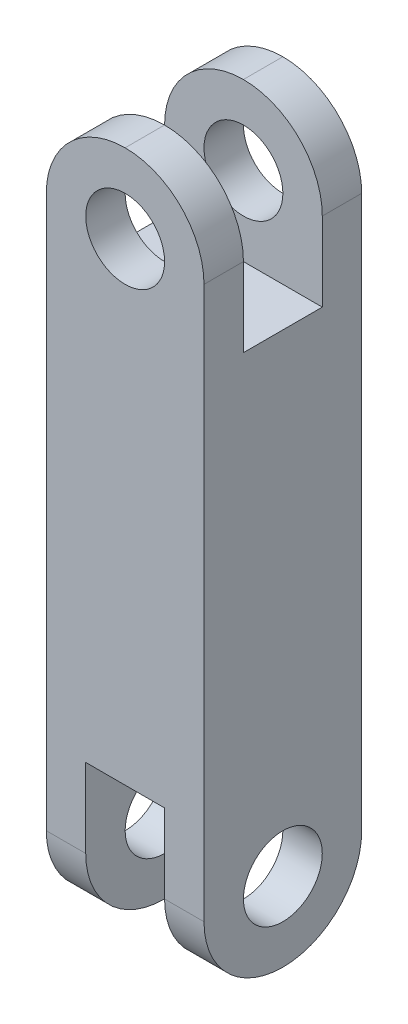
ISO-10303-21;
HEADER;
FILE_DESCRIPTION(('STEP AP214'),'2;1');
FILE_NAME('part.step','',(''),(''),'','','');
FILE_SCHEMA(('AUTOMOTIVE_DESIGN { 1 0 10303 214 1 1 1 1 }'));
ENDSEC;
DATA;
#1=APPLICATION_CONTEXT('core data for automotive mechanical design processes');
#2=APPLICATION_PROTOCOL_DEFINITION('international standard','automotive_design',2000,#1);
#3=PRODUCT_CONTEXT('',#1,'mechanical');
#4=PRODUCT('Part','Part','',(#3));
#5=PRODUCT_RELATED_PRODUCT_CATEGORY('part','',(#4));
#6=PRODUCT_DEFINITION_FORMATION('','',#4);
#7=PRODUCT_DEFINITION_CONTEXT('part definition',#1,'design');
#8=PRODUCT_DEFINITION('design','',#6,#7);
#9=PRODUCT_DEFINITION_SHAPE('','',#8);
#10=(LENGTH_UNIT() NAMED_UNIT(*) SI_UNIT(.MILLI.,.METRE.));
#11=(NAMED_UNIT(*) PLANE_ANGLE_UNIT() SI_UNIT($,.RADIAN.));
#12=(NAMED_UNIT(*) SI_UNIT($,.STERADIAN.) SOLID_ANGLE_UNIT());
#13=UNCERTAINTY_MEASURE_WITH_UNIT(LENGTH_MEASURE(1.E-05),#10,'distance_accuracy_value','');
#14=(GEOMETRIC_REPRESENTATION_CONTEXT(3) GLOBAL_UNCERTAINTY_ASSIGNED_CONTEXT((#13)) GLOBAL_UNIT_ASSIGNED_CONTEXT((#10,
#11,#12)) REPRESENTATION_CONTEXT('',''));
#15=CARTESIAN_POINT('',(0.,0.,0.));
#16=DIRECTION('',(0.,0.,1.));
#17=DIRECTION('',(1.,0.,0.));
#18=AXIS2_PLACEMENT_3D('',#15,#16,#17);
#19=CARTESIAN_POINT('',(0.,406.4,-50.8));
#20=DIRECTION('',(0.,0.,1.));
#21=DIRECTION('',(1.,0.,0.));
#22=AXIS2_PLACEMENT_3D('',#19,#20,#21);
#23=CYLINDRICAL_SURFACE('',#22,25.4);
#24=CARTESIAN_POINT('',(0.,406.4,25.4));
#25=DIRECTION('',(0.,0.,1.));
#26=DIRECTION('',(0.,-1.,0.));
#27=AXIS2_PLACEMENT_3D('',#24,#25,#26);
#28=CIRCLE('',#27,25.4);
#29=CARTESIAN_POINT('',(0.,381.,25.4));
#30=VERTEX_POINT('',#29);
#31=EDGE_CURVE('E194',#30,#30,#28,.F.);
#32=ORIENTED_EDGE('',*,*,#31,.T.);
#33=EDGE_LOOP('',(#32));
#34=FACE_BOUND('',#33,.T.);
#35=CARTESIAN_POINT('',(0.,406.4,50.8));
#36=DIRECTION('',(0.,0.,1.));
#37=DIRECTION('',(1.,0.,0.));
#38=AXIS2_PLACEMENT_3D('',#35,#36,#37);
#39=CIRCLE('',#38,25.4);
#40=CARTESIAN_POINT('',(25.4,406.4,50.8));
#41=VERTEX_POINT('',#40);
#42=EDGE_CURVE('E205',#41,#41,#39,.T.);
#43=ORIENTED_EDGE('',*,*,#42,.T.);
#44=EDGE_LOOP('',(#43));
#45=FACE_BOUND('',#44,.T.);
#46=ADVANCED_FACE('F39',(#34,#45),#23,.F.);
#47=CARTESIAN_POINT('',(0.,406.4,0.));
#48=DIRECTION('',(0.,0.,-1.));
#49=DIRECTION('',(-1.,0.,0.));
#50=AXIS2_PLACEMENT_3D('',#47,#48,#49);
#51=CYLINDRICAL_SURFACE('',#50,50.8);
#52=CARTESIAN_POINT('',(0.,406.4,25.4));
#53=DIRECTION('',(0.,0.,1.));
#54=DIRECTION('',(0.,-1.,0.));
#55=AXIS2_PLACEMENT_3D('',#52,#53,#54);
#56=CIRCLE('',#55,50.8);
#57=CARTESIAN_POINT('',(0.,457.2,25.4));
#58=VERTEX_POINT('',#57);
#59=CARTESIAN_POINT('',(50.8,406.4,25.4));
#60=VERTEX_POINT('',#59);
#61=EDGE_CURVE('E192',#58,#60,#56,.F.);
#62=ORIENTED_EDGE('',*,*,#61,.F.);
#63=DIRECTION('',(0.,0.,-1.));
#64=VECTOR('',#63,1.);
#65=CARTESIAN_POINT('',(0.,457.2,0.));
#66=LINE('',#65,#64);
#67=CARTESIAN_POINT('',(0.,457.2,50.8));
#68=VERTEX_POINT('',#67);
#69=EDGE_CURVE('E227',#68,#58,#66,.T.);
#70=ORIENTED_EDGE('',*,*,#69,.F.);
#71=CARTESIAN_POINT('',(0.,406.4,50.8));
#72=DIRECTION('',(0.,0.,-1.));
#73=DIRECTION('',(-1.,0.,0.));
#74=AXIS2_PLACEMENT_3D('',#71,#72,#73);
#75=CIRCLE('',#74,50.8);
#76=CARTESIAN_POINT('',(50.8,406.4,50.8));
#77=VERTEX_POINT('',#76);
#78=EDGE_CURVE('E245',#77,#68,#75,.F.);
#79=ORIENTED_EDGE('',*,*,#78,.F.);
#80=DIRECTION('',(0.,0.,-1.));
#81=VECTOR('',#80,1.);
#82=CARTESIAN_POINT('',(50.8,406.4,50.8));
#83=LINE('',#82,#81);
#84=EDGE_CURVE('E272',#60,#77,#83,.F.);
#85=ORIENTED_EDGE('',*,*,#84,.F.);
#86=EDGE_LOOP('',(#62,#70,#79,#85));
#87=FACE_BOUND('',#86,.T.);
#88=ADVANCED_FACE('F335',(#87),#51,.T.);
#89=CARTESIAN_POINT('',(0.,406.4,0.));
#90=DIRECTION('',(0.,0.,1.));
#91=DIRECTION('',(1.,0.,0.));
#92=AXIS2_PLACEMENT_3D('',#89,#90,#91);
#93=CYLINDRICAL_SURFACE('',#92,50.8);
#94=CARTESIAN_POINT('',(0.,406.4,25.4));
#95=DIRECTION('',(0.,0.,1.));
#96=DIRECTION('',(0.,-1.,0.));
#97=AXIS2_PLACEMENT_3D('',#94,#95,#96);
#98=CIRCLE('',#97,50.8);
#99=CARTESIAN_POINT('',(-50.8,406.4,25.4));
#100=VERTEX_POINT('',#99);
#101=EDGE_CURVE('E11',#100,#58,#98,.F.);
#102=ORIENTED_EDGE('',*,*,#101,.F.);
#103=DIRECTION('',(0.,0.,1.));
#104=VECTOR('',#103,1.);
#105=CARTESIAN_POINT('',(-50.8,406.4,50.8));
#106=LINE('',#105,#104);
#107=CARTESIAN_POINT('',(-50.8,406.4,50.8));
#108=VERTEX_POINT('',#107);
#109=EDGE_CURVE('E254',#108,#100,#106,.F.);
#110=ORIENTED_EDGE('',*,*,#109,.F.);
#111=CARTESIAN_POINT('',(0.,406.4,50.8));
#112=DIRECTION('',(0.,0.,-1.));
#113=DIRECTION('',(-1.,0.,0.));
#114=AXIS2_PLACEMENT_3D('',#111,#112,#113);
#115=CIRCLE('',#114,50.8);
#116=EDGE_CURVE('E247',#68,#108,#115,.F.);
#117=ORIENTED_EDGE('',*,*,#116,.F.);
#118=ORIENTED_EDGE('',*,*,#69,.T.);
#119=EDGE_LOOP('',(#102,#110,#117,#118));
#120=FACE_BOUND('',#119,.T.);
#121=ADVANCED_FACE('F327',(#120),#93,.T.);
#122=CARTESIAN_POINT('',(50.8,457.2,50.8));
#123=DIRECTION('',(-1.,0.,0.));
#124=DIRECTION('',(0.,0.,1.));
#125=AXIS2_PLACEMENT_3D('',#122,#123,#124);
#126=PLANE('',#125);
#127=CARTESIAN_POINT('',(50.8,50.8,0.));
#128=DIRECTION('',(1.,0.,0.));
#129=DIRECTION('',(0.,0.,-1.));
#130=AXIS2_PLACEMENT_3D('',#127,#128,#129);
#131=CIRCLE('',#130,25.4);
#132=CARTESIAN_POINT('',(50.8,50.8,-25.4));
#133=VERTEX_POINT('',#132);
#134=EDGE_CURVE('E184',#133,#133,#131,.T.);
#135=ORIENTED_EDGE('',*,*,#134,.F.);
#136=EDGE_LOOP('',(#135));
#137=FACE_BOUND('',#136,.T.);
#138=DIRECTION('',(0.,0.,-1.));
#139=VECTOR('',#138,1.);
#140=CARTESIAN_POINT('',(50.8,355.6,25.4));
#141=LINE('',#140,#139);
#142=CARTESIAN_POINT('',(50.8,355.6,25.4));
#143=VERTEX_POINT('',#142);
#144=CARTESIAN_POINT('',(50.8,355.6,-25.4));
#145=VERTEX_POINT('',#144);
#146=EDGE_CURVE('E165',#143,#145,#141,.T.);
#147=ORIENTED_EDGE('',*,*,#146,.F.);
#148=DIRECTION('',(0.,-1.,0.));
#149=VECTOR('',#148,1.);
#150=CARTESIAN_POINT('',(50.8,355.6,25.4));
#151=LINE('',#150,#149);
#152=EDGE_CURVE('E169',#60,#143,#151,.T.);
#153=ORIENTED_EDGE('',*,*,#152,.F.);
#154=ORIENTED_EDGE('',*,*,#84,.T.);
#155=DIRECTION('',(0.,-1.,0.));
#156=VECTOR('',#155,1.);
#157=CARTESIAN_POINT('',(50.8,457.2,50.8));
#158=LINE('',#157,#156);
#159=CARTESIAN_POINT('',(50.8,50.8,50.8));
#160=VERTEX_POINT('',#159);
#161=EDGE_CURVE('E221',#77,#160,#158,.T.);
#162=ORIENTED_EDGE('',*,*,#161,.T.);
#163=CARTESIAN_POINT('',(50.8,50.8,0.));
#164=DIRECTION('',(-1.,0.,0.));
#165=DIRECTION('',(0.,0.,1.));
#166=AXIS2_PLACEMENT_3D('',#163,#164,#165);
#167=CIRCLE('',#166,50.8);
#168=CARTESIAN_POINT('',(50.8,0.,0.));
#169=VERTEX_POINT('',#168);
#170=EDGE_CURVE('E268',#160,#169,#167,.F.);
#171=ORIENTED_EDGE('',*,*,#170,.T.);
#172=CARTESIAN_POINT('',(50.8,50.8,0.));
#173=DIRECTION('',(-1.,0.,0.));
#174=DIRECTION('',(0.,0.,1.));
#175=AXIS2_PLACEMENT_3D('',#172,#173,#174);
#176=CIRCLE('',#175,50.8);
#177=CARTESIAN_POINT('',(50.8,50.8,-50.8));
#178=VERTEX_POINT('',#177);
#179=EDGE_CURVE('E270',#169,#178,#176,.F.);
#180=ORIENTED_EDGE('',*,*,#179,.T.);
#181=DIRECTION('',(0.,-1.,0.));
#182=VECTOR('',#181,1.);
#183=CARTESIAN_POINT('',(50.8,457.2,-50.8));
#184=LINE('',#183,#182);
#185=CARTESIAN_POINT('',(50.8,406.4,-50.8));
#186=VERTEX_POINT('',#185);
#187=EDGE_CURVE('E238',#186,#178,#184,.T.);
#188=ORIENTED_EDGE('',*,*,#187,.F.);
#189=CARTESIAN_POINT('',(50.8,406.4,-25.4));
#190=VERTEX_POINT('',#189);
#191=EDGE_CURVE('E175',#186,#190,#83,.F.);
#192=ORIENTED_EDGE('',*,*,#191,.T.);
#193=DIRECTION('',(0.,1.,0.));
#194=VECTOR('',#193,1.);
#195=CARTESIAN_POINT('',(50.8,355.6,-25.4));
#196=LINE('',#195,#194);
#197=EDGE_CURVE('E155',#145,#190,#196,.T.);
#198=ORIENTED_EDGE('',*,*,#197,.F.);
#199=EDGE_LOOP('',(#147,#153,#154,#162,#171,#180,#188,#192,#198));
#200=FACE_BOUND('',#199,.T.);
#201=ADVANCED_FACE('F172',(#137,#200),#126,.F.);
#202=CARTESIAN_POINT('',(-50.8,457.2,-50.8));
#203=DIRECTION('',(0.,0.,1.));
#204=DIRECTION('',(1.,0.,0.));
#205=AXIS2_PLACEMENT_3D('',#202,#203,#204);
#206=PLANE('',#205);
#207=CARTESIAN_POINT('',(0.,406.4,-50.8));
#208=DIRECTION('',(0.,0.,1.));
#209=DIRECTION('',(1.,0.,0.));
#210=AXIS2_PLACEMENT_3D('',#207,#208,#209);
#211=CIRCLE('',#210,25.4);
#212=CARTESIAN_POINT('',(25.4,406.4,-50.8));
#213=VERTEX_POINT('',#212);
#214=EDGE_CURVE('E224',#213,#213,#211,.T.);
#215=ORIENTED_EDGE('',*,*,#214,.T.);
#216=EDGE_LOOP('',(#215));
#217=FACE_BOUND('',#216,.T.);
#218=DIRECTION('',(0.,-1.,0.));
#219=VECTOR('',#218,1.);
#220=CARTESIAN_POINT('',(-50.8,457.2,-50.8));
#221=LINE('',#220,#219);
#222=CARTESIAN_POINT('',(-50.8,406.4,-50.8));
#223=VERTEX_POINT('',#222);
#224=CARTESIAN_POINT('',(-50.8,50.8,-50.8));
#225=VERTEX_POINT('',#224);
#226=EDGE_CURVE('E235',#223,#225,#221,.T.);
#227=ORIENTED_EDGE('',*,*,#226,.F.);
#228=CARTESIAN_POINT('',(0.,406.4,-50.8));
#229=DIRECTION('',(0.,0.,1.));
#230=DIRECTION('',(1.,0.,0.));
#231=AXIS2_PLACEMENT_3D('',#228,#229,#230);
#232=CIRCLE('',#231,50.8);
#233=CARTESIAN_POINT('',(0.,457.2,-50.8));
#234=VERTEX_POINT('',#233);
#235=EDGE_CURVE('E265',#223,#234,#232,.F.);
#236=ORIENTED_EDGE('',*,*,#235,.T.);
#237=CARTESIAN_POINT('',(0.,406.4,-50.8));
#238=DIRECTION('',(0.,0.,1.));
#239=DIRECTION('',(1.,0.,0.));
#240=AXIS2_PLACEMENT_3D('',#237,#238,#239);
#241=CIRCLE('',#240,50.8);
#242=EDGE_CURVE('E263',#234,#186,#241,.F.);
#243=ORIENTED_EDGE('',*,*,#242,.T.);
#244=ORIENTED_EDGE('',*,*,#187,.T.);
#245=DIRECTION('',(-1.,0.,0.));
#246=VECTOR('',#245,1.);
#247=CARTESIAN_POINT('',(25.4,50.8,-50.8));
#248=LINE('',#247,#246);
#249=CARTESIAN_POINT('',(25.4,50.8,-50.8));
#250=VERTEX_POINT('',#249);
#251=EDGE_CURVE('E257',#178,#250,#248,.T.);
#252=ORIENTED_EDGE('',*,*,#251,.T.);
#253=DIRECTION('',(0.,1.,0.));
#254=VECTOR('',#253,1.);
#255=CARTESIAN_POINT('',(25.4,0.,-50.8));
#256=LINE('',#255,#254);
#257=CARTESIAN_POINT('',(25.4,101.6,-50.8));
#258=VERTEX_POINT('',#257);
#259=EDGE_CURVE('E213',#250,#258,#256,.T.);
#260=ORIENTED_EDGE('',*,*,#259,.T.);
#261=DIRECTION('',(-1.,0.,0.));
#262=VECTOR('',#261,1.);
#263=CARTESIAN_POINT('',(-25.4,101.6,-50.8));
#264=LINE('',#263,#262);
#265=CARTESIAN_POINT('',(-25.4,101.6,-50.8));
#266=VERTEX_POINT('',#265);
#267=EDGE_CURVE('E215',#258,#266,#264,.T.);
#268=ORIENTED_EDGE('',*,*,#267,.T.);
#269=DIRECTION('',(0.,-1.,0.));
#270=VECTOR('',#269,1.);
#271=CARTESIAN_POINT('',(-25.4,0.,-50.8));
#272=LINE('',#271,#270);
#273=CARTESIAN_POINT('',(-25.4,50.8,-50.8));
#274=VERTEX_POINT('',#273);
#275=EDGE_CURVE('E210',#266,#274,#272,.T.);
#276=ORIENTED_EDGE('',*,*,#275,.T.);
#277=DIRECTION('',(-1.,0.,0.));
#278=VECTOR('',#277,1.);
#279=CARTESIAN_POINT('',(-50.8,50.8,-50.8));
#280=LINE('',#279,#278);
#281=EDGE_CURVE('E260',#274,#225,#280,.T.);
#282=ORIENTED_EDGE('',*,*,#281,.T.);
#283=EDGE_LOOP('',(#227,#236,#243,#244,#252,#260,#268,#276,#282));
#284=FACE_BOUND('',#283,.T.);
#285=ADVANCED_FACE('F299',(#217,#284),#206,.F.);
#286=CARTESIAN_POINT('',(-50.8,457.2,50.8));
#287=DIRECTION('',(1.,0.,0.));
#288=DIRECTION('',(0.,0.,-1.));
#289=AXIS2_PLACEMENT_3D('',#286,#287,#288);
#290=PLANE('',#289);
#291=CARTESIAN_POINT('',(-50.8,50.8,0.));
#292=DIRECTION('',(1.,0.,0.));
#293=DIRECTION('',(0.,0.,-1.));
#294=AXIS2_PLACEMENT_3D('',#291,#292,#293);
#295=CIRCLE('',#294,25.4);
#296=CARTESIAN_POINT('',(-50.8,50.8,-25.4));
#297=VERTEX_POINT('',#296);
#298=EDGE_CURVE('E189',#297,#297,#295,.T.);
#299=ORIENTED_EDGE('',*,*,#298,.T.);
#300=EDGE_LOOP('',(#299));
#301=FACE_BOUND('',#300,.T.);
#302=ORIENTED_EDGE('',*,*,#109,.T.);
#303=DIRECTION('',(0.,-1.,0.));
#304=VECTOR('',#303,1.);
#305=CARTESIAN_POINT('',(-50.8,355.6,25.4));
#306=LINE('',#305,#304);
#307=CARTESIAN_POINT('',(-50.8,355.6,25.4));
#308=VERTEX_POINT('',#307);
#309=EDGE_CURVE('E176',#100,#308,#306,.T.);
#310=ORIENTED_EDGE('',*,*,#309,.T.);
#311=DIRECTION('',(0.,0.,-1.));
#312=VECTOR('',#311,1.);
#313=CARTESIAN_POINT('',(-50.8,355.6,25.4));
#314=LINE('',#313,#312);
#315=CARTESIAN_POINT('',(-50.8,355.6,-25.4));
#316=VERTEX_POINT('',#315);
#317=EDGE_CURVE('E179',#308,#316,#314,.T.);
#318=ORIENTED_EDGE('',*,*,#317,.T.);
#319=DIRECTION('',(0.,1.,0.));
#320=VECTOR('',#319,1.);
#321=CARTESIAN_POINT('',(-50.8,355.6,-25.4));
#322=LINE('',#321,#320);
#323=CARTESIAN_POINT('',(-50.8,406.4,-25.4));
#324=VERTEX_POINT('',#323);
#325=EDGE_CURVE('E157',#316,#324,#322,.T.);
#326=ORIENTED_EDGE('',*,*,#325,.T.);
#327=EDGE_CURVE('E253',#324,#223,#106,.F.);
#328=ORIENTED_EDGE('',*,*,#327,.T.);
#329=ORIENTED_EDGE('',*,*,#226,.T.);
#330=CARTESIAN_POINT('',(-50.8,50.8,0.));
#331=DIRECTION('',(1.,0.,0.));
#332=DIRECTION('',(0.,0.,-1.));
#333=AXIS2_PLACEMENT_3D('',#330,#331,#332);
#334=CIRCLE('',#333,50.8);
#335=CARTESIAN_POINT('',(-50.8,0.,0.));
#336=VERTEX_POINT('',#335);
#337=EDGE_CURVE('E251',#225,#336,#334,.F.);
#338=ORIENTED_EDGE('',*,*,#337,.T.);
#339=CARTESIAN_POINT('',(-50.8,50.8,0.));
#340=DIRECTION('',(1.,0.,0.));
#341=DIRECTION('',(0.,0.,-1.));
#342=AXIS2_PLACEMENT_3D('',#339,#340,#341);
#343=CIRCLE('',#342,50.8);
#344=CARTESIAN_POINT('',(-50.8,50.8,50.8));
#345=VERTEX_POINT('',#344);
#346=EDGE_CURVE('E249',#336,#345,#343,.F.);
#347=ORIENTED_EDGE('',*,*,#346,.T.);
#348=DIRECTION('',(0.,-1.,0.));
#349=VECTOR('',#348,1.);
#350=CARTESIAN_POINT('',(-50.8,457.2,50.8));
#351=LINE('',#350,#349);
#352=EDGE_CURVE('E232',#108,#345,#351,.T.);
#353=ORIENTED_EDGE('',*,*,#352,.F.);
#354=EDGE_LOOP('',(#302,#310,#318,#326,#328,#329,#338,#347,#353));
#355=FACE_BOUND('',#354,.T.);
#356=ADVANCED_FACE('F293',(#301,#355),#290,.F.);
#357=CARTESIAN_POINT('',(-50.8,457.2,50.8));
#358=DIRECTION('',(0.,0.,-1.));
#359=DIRECTION('',(-1.,0.,0.));
#360=AXIS2_PLACEMENT_3D('',#357,#358,#359);
#361=PLANE('',#360);
#362=ORIENTED_EDGE('',*,*,#42,.F.);
#363=EDGE_LOOP('',(#362));
#364=FACE_BOUND('',#363,.T.);
#365=ORIENTED_EDGE('',*,*,#78,.T.);
#366=ORIENTED_EDGE('',*,*,#116,.T.);
#367=ORIENTED_EDGE('',*,*,#352,.T.);
#368=DIRECTION('',(1.,0.,0.));
#369=VECTOR('',#368,1.);
#370=CARTESIAN_POINT('',(-25.4,50.8,50.8));
#371=LINE('',#370,#369);
#372=CARTESIAN_POINT('',(-25.4,50.8,50.8));
#373=VERTEX_POINT('',#372);
#374=EDGE_CURVE('E243',#345,#373,#371,.T.);
#375=ORIENTED_EDGE('',*,*,#374,.T.);
#376=DIRECTION('',(0.,-1.,0.));
#377=VECTOR('',#376,1.);
#378=CARTESIAN_POINT('',(-25.4,0.,50.8));
#379=LINE('',#378,#377);
#380=CARTESIAN_POINT('',(-25.4,101.6,50.8));
#381=VERTEX_POINT('',#380);
#382=EDGE_CURVE('E201',#381,#373,#379,.T.);
#383=ORIENTED_EDGE('',*,*,#382,.F.);
#384=DIRECTION('',(-1.,0.,0.));
#385=VECTOR('',#384,1.);
#386=CARTESIAN_POINT('',(-25.4,101.6,50.8));
#387=LINE('',#386,#385);
#388=CARTESIAN_POINT('',(25.4,101.6,50.8));
#389=VERTEX_POINT('',#388);
#390=EDGE_CURVE('E207',#389,#381,#387,.T.);
#391=ORIENTED_EDGE('',*,*,#390,.F.);
#392=DIRECTION('',(0.,1.,0.));
#393=VECTOR('',#392,1.);
#394=CARTESIAN_POINT('',(25.4,0.,50.8));
#395=LINE('',#394,#393);
#396=CARTESIAN_POINT('',(25.4,50.8,50.8));
#397=VERTEX_POINT('',#396);
#398=EDGE_CURVE('E204',#397,#389,#395,.T.);
#399=ORIENTED_EDGE('',*,*,#398,.F.);
#400=DIRECTION('',(1.,0.,0.));
#401=VECTOR('',#400,1.);
#402=CARTESIAN_POINT('',(50.8,50.8,50.8));
#403=LINE('',#402,#401);
#404=EDGE_CURVE('E241',#397,#160,#403,.T.);
#405=ORIENTED_EDGE('',*,*,#404,.T.);
#406=ORIENTED_EDGE('',*,*,#161,.F.);
#407=EDGE_LOOP('',(#365,#366,#367,#375,#383,#391,#399,#405,#406));
#408=FACE_BOUND('',#407,.T.);
#409=ADVANCED_FACE('F321',(#364,#408),#361,.F.);
#410=CARTESIAN_POINT('',(-25.4,0.,-50.8));
#411=DIRECTION('',(-1.,0.,0.));
#412=DIRECTION('',(0.,0.,1.));
#413=AXIS2_PLACEMENT_3D('',#410,#411,#412);
#414=PLANE('',#413);
#415=CARTESIAN_POINT('',(-25.4,50.8,0.));
#416=DIRECTION('',(-1.,0.,0.));
#417=DIRECTION('',(0.,0.,1.));
#418=AXIS2_PLACEMENT_3D('',#415,#416,#417);
#419=CIRCLE('',#418,25.4);
#420=CARTESIAN_POINT('',(-25.4,50.8,25.4));
#421=VERTEX_POINT('',#420);
#422=EDGE_CURVE('E197',#421,#421,#419,.T.);
#423=ORIENTED_EDGE('',*,*,#422,.T.);
#424=EDGE_LOOP('',(#423));
#425=FACE_BOUND('',#424,.T.);
#426=CARTESIAN_POINT('',(-25.4,50.8,0.));
#427=DIRECTION('',(-1.,0.,0.));
#428=DIRECTION('',(0.,0.,1.));
#429=AXIS2_PLACEMENT_3D('',#426,#427,#428);
#430=CIRCLE('',#429,50.8);
#431=CARTESIAN_POINT('',(-25.4,0.,0.));
#432=VERTEX_POINT('',#431);
#433=EDGE_CURVE('E274',#373,#432,#430,.F.);
#434=ORIENTED_EDGE('',*,*,#433,.T.);
#435=CARTESIAN_POINT('',(-25.4,50.8,0.));
#436=DIRECTION('',(-1.,0.,0.));
#437=DIRECTION('',(0.,0.,1.));
#438=AXIS2_PLACEMENT_3D('',#435,#436,#437);
#439=CIRCLE('',#438,50.8);
#440=EDGE_CURVE('E276',#432,#274,#439,.F.);
#441=ORIENTED_EDGE('',*,*,#440,.T.);
#442=ORIENTED_EDGE('',*,*,#275,.F.);
#443=DIRECTION('',(0.,0.,1.));
#444=VECTOR('',#443,1.);
#445=CARTESIAN_POINT('',(-25.4,101.6,-50.8));
#446=LINE('',#445,#444);
#447=EDGE_CURVE('E219',#266,#381,#446,.T.);
#448=ORIENTED_EDGE('',*,*,#447,.T.);
#449=ORIENTED_EDGE('',*,*,#382,.T.);
#450=EDGE_LOOP('',(#434,#441,#442,#448,#449));
#451=FACE_BOUND('',#450,.T.);
#452=ADVANCED_FACE('F313',(#425,#451),#414,.F.);
#453=CARTESIAN_POINT('',(-25.4,101.6,-50.8));
#454=DIRECTION('',(0.,1.,0.));
#455=DIRECTION('',(0.,0.,1.));
#456=AXIS2_PLACEMENT_3D('',#453,#454,#455);
#457=PLANE('',#456);
#458=ORIENTED_EDGE('',*,*,#447,.F.);
#459=ORIENTED_EDGE('',*,*,#267,.F.);
#460=DIRECTION('',(0.,0.,1.));
#461=VECTOR('',#460,1.);
#462=CARTESIAN_POINT('',(25.4,101.6,-50.8));
#463=LINE('',#462,#461);
#464=EDGE_CURVE('E218',#258,#389,#463,.T.);
#465=ORIENTED_EDGE('',*,*,#464,.T.);
#466=ORIENTED_EDGE('',*,*,#390,.T.);
#467=EDGE_LOOP('',(#458,#459,#465,#466));
#468=FACE_BOUND('',#467,.T.);
#469=ADVANCED_FACE('F317',(#468),#457,.F.);
#470=CARTESIAN_POINT('',(25.4,0.,-50.8));
#471=DIRECTION('',(1.,0.,0.));
#472=DIRECTION('',(0.,0.,-1.));
#473=AXIS2_PLACEMENT_3D('',#470,#471,#472);
#474=PLANE('',#473);
#475=CARTESIAN_POINT('',(25.4,50.8,0.));
#476=DIRECTION('',(1.,0.,0.));
#477=DIRECTION('',(0.,0.,-1.));
#478=AXIS2_PLACEMENT_3D('',#475,#476,#477);
#479=CIRCLE('',#478,25.4);
#480=CARTESIAN_POINT('',(25.4,50.8,-25.4));
#481=VERTEX_POINT('',#480);
#482=EDGE_CURVE('E43',#481,#481,#479,.T.);
#483=ORIENTED_EDGE('',*,*,#482,.T.);
#484=EDGE_LOOP('',(#483));
#485=FACE_BOUND('',#484,.T.);
#486=ORIENTED_EDGE('',*,*,#259,.F.);
#487=CARTESIAN_POINT('',(25.4,50.8,0.));
#488=DIRECTION('',(1.,0.,0.));
#489=DIRECTION('',(0.,0.,-1.));
#490=AXIS2_PLACEMENT_3D('',#487,#488,#489);
#491=CIRCLE('',#490,50.8);
#492=CARTESIAN_POINT('',(25.4,0.,0.));
#493=VERTEX_POINT('',#492);
#494=EDGE_CURVE('E63',#250,#493,#491,.F.);
#495=ORIENTED_EDGE('',*,*,#494,.T.);
#496=CARTESIAN_POINT('',(25.4,50.8,0.));
#497=DIRECTION('',(1.,0.,0.));
#498=DIRECTION('',(0.,0.,-1.));
#499=AXIS2_PLACEMENT_3D('',#496,#497,#498);
#500=CIRCLE('',#499,50.8);
#501=EDGE_CURVE('E278',#493,#397,#500,.F.);
#502=ORIENTED_EDGE('',*,*,#501,.T.);
#503=ORIENTED_EDGE('',*,*,#398,.T.);
#504=ORIENTED_EDGE('',*,*,#464,.F.);
#505=EDGE_LOOP('',(#486,#495,#502,#503,#504));
#506=FACE_BOUND('',#505,.T.);
#507=ADVANCED_FACE('F366',(#485,#506),#474,.F.);
#508=CARTESIAN_POINT('',(0.,406.4,-25.4));
#509=DIRECTION('',(0.,0.,-1.));
#510=DIRECTION('',(-1.,0.,0.));
#511=AXIS2_PLACEMENT_3D('',#508,#509,#510);
#512=CIRCLE('',#511,25.4);
#513=CARTESIAN_POINT('',(-25.4,406.4,-25.4));
#514=VERTEX_POINT('',#513);
#515=EDGE_CURVE('E188',#514,#514,#512,.F.);
#516=ORIENTED_EDGE('',*,*,#515,.T.);
#517=EDGE_LOOP('',(#516));
#518=FACE_BOUND('',#517,.T.);
#519=ORIENTED_EDGE('',*,*,#214,.F.);
#520=EDGE_LOOP('',(#519));
#521=FACE_BOUND('',#520,.T.);
#522=ADVANCED_FACE('F356',(#518,#521),#23,.F.);
#523=CARTESIAN_POINT('',(0.,406.4,-25.4));
#524=DIRECTION('',(0.,0.,-1.));
#525=DIRECTION('',(-1.,0.,0.));
#526=AXIS2_PLACEMENT_3D('',#523,#524,#525);
#527=CIRCLE('',#526,50.8);
#528=CARTESIAN_POINT('',(0.,457.2,-25.4));
#529=VERTEX_POINT('',#528);
#530=EDGE_CURVE('E55',#190,#529,#527,.F.);
#531=ORIENTED_EDGE('',*,*,#530,.F.);
#532=ORIENTED_EDGE('',*,*,#191,.F.);
#533=ORIENTED_EDGE('',*,*,#242,.F.);
#534=EDGE_CURVE('E283',#529,#234,#66,.T.);
#535=ORIENTED_EDGE('',*,*,#534,.F.);
#536=EDGE_LOOP('',(#531,#532,#533,#535));
#537=FACE_BOUND('',#536,.T.);
#538=ADVANCED_FACE('F361',(#537),#51,.T.);
#539=CARTESIAN_POINT('',(0.,406.4,-25.4));
#540=DIRECTION('',(0.,0.,-1.));
#541=DIRECTION('',(-1.,0.,0.));
#542=AXIS2_PLACEMENT_3D('',#539,#540,#541);
#543=CIRCLE('',#542,50.8);
#544=EDGE_CURVE('E48',#529,#324,#543,.F.);
#545=ORIENTED_EDGE('',*,*,#544,.F.);
#546=ORIENTED_EDGE('',*,*,#534,.T.);
#547=ORIENTED_EDGE('',*,*,#235,.F.);
#548=ORIENTED_EDGE('',*,*,#327,.F.);
#549=EDGE_LOOP('',(#545,#546,#547,#548));
#550=FACE_BOUND('',#549,.T.);
#551=ADVANCED_FACE('F295',(#550),#93,.T.);
#552=CARTESIAN_POINT('',(-50.8,50.8,0.));
#553=DIRECTION('',(-1.,0.,0.));
#554=DIRECTION('',(0.,0.,1.));
#555=AXIS2_PLACEMENT_3D('',#552,#553,#554);
#556=CYLINDRICAL_SURFACE('',#555,50.8);
#557=DIRECTION('',(1.,0.,0.));
#558=VECTOR('',#557,1.);
#559=CARTESIAN_POINT('',(-50.8,0.,0.));
#560=LINE('',#559,#558);
#561=EDGE_CURVE('E284',#432,#336,#560,.F.);
#562=ORIENTED_EDGE('',*,*,#561,.F.);
#563=ORIENTED_EDGE('',*,*,#433,.F.);
#564=ORIENTED_EDGE('',*,*,#374,.F.);
#565=ORIENTED_EDGE('',*,*,#346,.F.);
#566=EDGE_LOOP('',(#562,#563,#564,#565));
#567=FACE_BOUND('',#566,.T.);
#568=ADVANCED_FACE('F307',(#567),#556,.T.);
#569=CARTESIAN_POINT('',(-50.8,50.8,0.));
#570=DIRECTION('',(1.,0.,0.));
#571=DIRECTION('',(0.,0.,-1.));
#572=AXIS2_PLACEMENT_3D('',#569,#570,#571);
#573=CYLINDRICAL_SURFACE('',#572,50.8);
#574=ORIENTED_EDGE('',*,*,#440,.F.);
#575=ORIENTED_EDGE('',*,*,#561,.T.);
#576=ORIENTED_EDGE('',*,*,#337,.F.);
#577=ORIENTED_EDGE('',*,*,#281,.F.);
#578=EDGE_LOOP('',(#574,#575,#576,#577));
#579=FACE_BOUND('',#578,.T.);
#580=ADVANCED_FACE('F310',(#579),#573,.T.);
#581=CARTESIAN_POINT('',(-50.8,50.8,0.));
#582=DIRECTION('',(-1.,0.,0.));
#583=DIRECTION('',(0.,0.,1.));
#584=AXIS2_PLACEMENT_3D('',#581,#582,#583);
#585=CYLINDRICAL_SURFACE('',#584,50.8);
#586=DIRECTION('',(1.,0.,0.));
#587=VECTOR('',#586,1.);
#588=CARTESIAN_POINT('',(25.4,0.,0.));
#589=LINE('',#588,#587);
#590=EDGE_CURVE('E200',#169,#493,#589,.F.);
#591=ORIENTED_EDGE('',*,*,#590,.F.);
#592=ORIENTED_EDGE('',*,*,#170,.F.);
#593=ORIENTED_EDGE('',*,*,#404,.F.);
#594=ORIENTED_EDGE('',*,*,#501,.F.);
#595=EDGE_LOOP('',(#591,#592,#593,#594));
#596=FACE_BOUND('',#595,.T.);
#597=ADVANCED_FACE('F41',(#596),#585,.T.);
#598=CARTESIAN_POINT('',(-50.8,50.8,0.));
#599=DIRECTION('',(1.,0.,0.));
#600=DIRECTION('',(0.,0.,-1.));
#601=AXIS2_PLACEMENT_3D('',#598,#599,#600);
#602=CYLINDRICAL_SURFACE('',#601,50.8);
#603=ORIENTED_EDGE('',*,*,#179,.F.);
#604=ORIENTED_EDGE('',*,*,#590,.T.);
#605=ORIENTED_EDGE('',*,*,#494,.F.);
#606=ORIENTED_EDGE('',*,*,#251,.F.);
#607=EDGE_LOOP('',(#603,#604,#605,#606));
#608=FACE_BOUND('',#607,.T.);
#609=ADVANCED_FACE('F345',(#608),#602,.T.);
#610=CARTESIAN_POINT('',(-50.8,355.6,25.4));
#611=DIRECTION('',(0.,0.,1.));
#612=DIRECTION('',(0.,-1.,0.));
#613=AXIS2_PLACEMENT_3D('',#610,#611,#612);
#614=PLANE('',#613);
#615=ORIENTED_EDGE('',*,*,#61,.T.);
#616=ORIENTED_EDGE('',*,*,#152,.T.);
#617=DIRECTION('',(1.,0.,0.));
#618=VECTOR('',#617,1.);
#619=CARTESIAN_POINT('',(-50.8,355.6,25.4));
#620=LINE('',#619,#618);
#621=EDGE_CURVE('E161',#308,#143,#620,.T.);
#622=ORIENTED_EDGE('',*,*,#621,.F.);
#623=ORIENTED_EDGE('',*,*,#309,.F.);
#624=ORIENTED_EDGE('',*,*,#101,.T.);
#625=EDGE_LOOP('',(#615,#616,#622,#623,#624));
#626=FACE_BOUND('',#625,.T.);
#627=ORIENTED_EDGE('',*,*,#31,.F.);
#628=EDGE_LOOP('',(#627));
#629=FACE_BOUND('',#628,.T.);
#630=ADVANCED_FACE('F331',(#626,#629),#614,.F.);
#631=CARTESIAN_POINT('',(-50.8,355.6,-25.4));
#632=DIRECTION('',(0.,0.,-1.));
#633=DIRECTION('',(-1.,0.,0.));
#634=AXIS2_PLACEMENT_3D('',#631,#632,#633);
#635=PLANE('',#634);
#636=ORIENTED_EDGE('',*,*,#530,.T.);
#637=ORIENTED_EDGE('',*,*,#544,.T.);
#638=ORIENTED_EDGE('',*,*,#325,.F.);
#639=DIRECTION('',(1.,0.,0.));
#640=VECTOR('',#639,1.);
#641=CARTESIAN_POINT('',(-50.8,355.6,-25.4));
#642=LINE('',#641,#640);
#643=EDGE_CURVE('E150',#316,#145,#642,.T.);
#644=ORIENTED_EDGE('',*,*,#643,.T.);
#645=ORIENTED_EDGE('',*,*,#197,.T.);
#646=EDGE_LOOP('',(#636,#637,#638,#644,#645));
#647=FACE_BOUND('',#646,.T.);
#648=ORIENTED_EDGE('',*,*,#515,.F.);
#649=EDGE_LOOP('',(#648));
#650=FACE_BOUND('',#649,.T.);
#651=ADVANCED_FACE('F152',(#647,#650),#635,.F.);
#652=CARTESIAN_POINT('',(-50.8,355.6,25.4));
#653=DIRECTION('',(0.,-1.,0.));
#654=DIRECTION('',(0.,0.,-1.));
#655=AXIS2_PLACEMENT_3D('',#652,#653,#654);
#656=PLANE('',#655);
#657=ORIENTED_EDGE('',*,*,#146,.T.);
#658=ORIENTED_EDGE('',*,*,#643,.F.);
#659=ORIENTED_EDGE('',*,*,#317,.F.);
#660=ORIENTED_EDGE('',*,*,#621,.T.);
#661=EDGE_LOOP('',(#657,#658,#659,#660));
#662=FACE_BOUND('',#661,.T.);
#663=ADVANCED_FACE('F166',(#662),#656,.F.);
#664=CARTESIAN_POINT('',(-50.8,50.8,0.));
#665=DIRECTION('',(1.,0.,0.));
#666=DIRECTION('',(0.,0.,-1.));
#667=AXIS2_PLACEMENT_3D('',#664,#665,#666);
#668=CYLINDRICAL_SURFACE('',#667,25.4);
#669=ORIENTED_EDGE('',*,*,#134,.T.);
#670=EDGE_LOOP('',(#669));
#671=FACE_BOUND('',#670,.T.);
#672=ORIENTED_EDGE('',*,*,#482,.F.);
#673=EDGE_LOOP('',(#672));
#674=FACE_BOUND('',#673,.T.);
#675=ADVANCED_FACE('F507',(#671,#674),#668,.F.);
#676=ORIENTED_EDGE('',*,*,#298,.F.);
#677=EDGE_LOOP('',(#676));
#678=FACE_BOUND('',#677,.T.);
#679=ORIENTED_EDGE('',*,*,#422,.F.);
#680=EDGE_LOOP('',(#679));
#681=FACE_BOUND('',#680,.T.);
#682=ADVANCED_FACE('F517',(#678,#681),#668,.F.);
#683=CLOSED_SHELL('',(#46,#88,#121,#201,#285,#356,#409,#452,#469,#507,#522,#538,#551,#568,#580,
#597,#609,#630,#651,#663,#675,#682));
#684=MANIFOLD_SOLID_BREP('B2',#683);
#685=ADVANCED_BREP_SHAPE_REPRESENTATION('',(#18,#684),#14);
#686=SHAPE_DEFINITION_REPRESENTATION(#9,#685);
ENDSEC;
END-ISO-10303-21;
